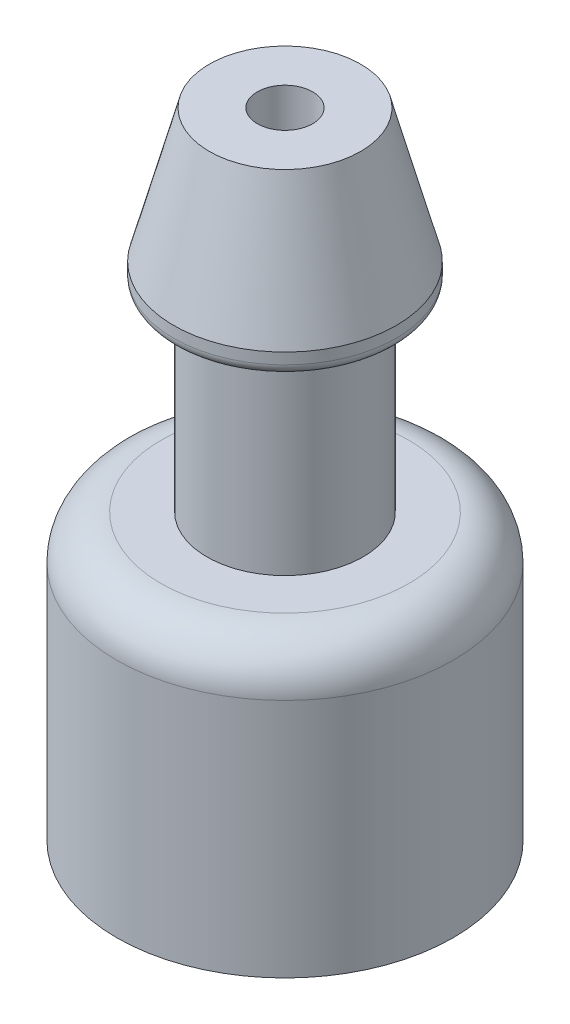
ISO-10303-21;
HEADER;
FILE_DESCRIPTION(('STEP AP214'),'2;1');
FILE_NAME('part.step','',(''),(''),'','','');
FILE_SCHEMA(('AUTOMOTIVE_DESIGN { 1 0 10303 214 1 1 1 1 }'));
ENDSEC;
DATA;
#1=APPLICATION_CONTEXT('core data for automotive mechanical design processes');
#2=APPLICATION_PROTOCOL_DEFINITION('international standard','automotive_design',2000,#1);
#3=PRODUCT_CONTEXT('',#1,'mechanical');
#4=PRODUCT('Part','Part','',(#3));
#5=PRODUCT_RELATED_PRODUCT_CATEGORY('part','',(#4));
#6=PRODUCT_DEFINITION_FORMATION('','',#4);
#7=PRODUCT_DEFINITION_CONTEXT('part definition',#1,'design');
#8=PRODUCT_DEFINITION('design','',#6,#7);
#9=PRODUCT_DEFINITION_SHAPE('','',#8);
#10=(LENGTH_UNIT() NAMED_UNIT(*) SI_UNIT(.MILLI.,.METRE.));
#11=(NAMED_UNIT(*) PLANE_ANGLE_UNIT() SI_UNIT($,.RADIAN.));
#12=(NAMED_UNIT(*) SI_UNIT($,.STERADIAN.) SOLID_ANGLE_UNIT());
#13=UNCERTAINTY_MEASURE_WITH_UNIT(LENGTH_MEASURE(1.E-05),#10,'distance_accuracy_value','');
#14=(GEOMETRIC_REPRESENTATION_CONTEXT(3) GLOBAL_UNCERTAINTY_ASSIGNED_CONTEXT((#13)) GLOBAL_UNIT_ASSIGNED_CONTEXT((#10,
#11,#12)) REPRESENTATION_CONTEXT('',''));
#15=CARTESIAN_POINT('',(0.,0.,0.));
#16=DIRECTION('',(0.,0.,1.));
#17=DIRECTION('',(1.,0.,0.));
#18=AXIS2_PLACEMENT_3D('',#15,#16,#17);
#19=CARTESIAN_POINT('',(0.,25.0000000000341,0.));
#20=DIRECTION('',(0.,-1.,0.));
#21=DIRECTION('',(1.,0.,0.));
#22=AXIS2_PLACEMENT_3D('',#19,#20,#21);
#23=CONICAL_SURFACE('',#22,5.02499999998918,0.261977344231984);
#24=CARTESIAN_POINT('',(0.,25.,0.));
#25=DIRECTION('',(0.,-1.,0.));
#26=DIRECTION('',(0.,0.,-1.));
#27=AXIS2_PLACEMENT_3D('',#24,#25,#26);
#28=CIRCLE('',#27,5.025);
#29=CARTESIAN_POINT('',(0.,25.,-5.025));
#30=VERTEX_POINT('',#29);
#31=EDGE_CURVE('E125',#30,#30,#28,.T.);
#32=ORIENTED_EDGE('',*,*,#31,.F.);
#33=EDGE_LOOP('',(#32));
#34=FACE_BOUND('',#33,.T.);
#35=CARTESIAN_POINT('',(0.,30.9999999998922,0.));
#36=DIRECTION('',(0.,-1.,0.));
#37=DIRECTION('',(1.,0.,0.));
#38=AXIS2_PLACEMENT_3D('',#35,#36,#37);
#39=CIRCLE('',#38,3.41616039207793);
#40=CARTESIAN_POINT('',(3.41616039207794,30.9999999998922,0.));
#41=VERTEX_POINT('',#40);
#42=EDGE_CURVE('E20',#41,#41,#39,.F.);
#43=ORIENTED_EDGE('',*,*,#42,.F.);
#44=EDGE_LOOP('',(#43));
#45=FACE_BOUND('',#44,.T.);
#46=ADVANCED_FACE('F16',(#34,#45),#23,.T.);
#47=CARTESIAN_POINT('',(0.,31.,0.));
#48=DIRECTION('',(0.,1.,0.));
#49=DIRECTION('',(0.,0.,1.));
#50=AXIS2_PLACEMENT_3D('',#47,#48,#49);
#51=PLANE('',#50);
#52=ORIENTED_EDGE('',*,*,#42,.T.);
#53=EDGE_LOOP('',(#52));
#54=FACE_BOUND('',#53,.T.);
#55=CARTESIAN_POINT('',(0.,31.,0.));
#56=DIRECTION('',(0.,-1.,0.));
#57=DIRECTION('',(0.,0.,-1.));
#58=AXIS2_PLACEMENT_3D('',#55,#56,#57);
#59=CIRCLE('',#58,1.25);
#60=CARTESIAN_POINT('',(0.,31.,-1.25));
#61=VERTEX_POINT('',#60);
#62=EDGE_CURVE('E124',#61,#61,#59,.T.);
#63=ORIENTED_EDGE('',*,*,#62,.T.);
#64=EDGE_LOOP('',(#63));
#65=FACE_BOUND('',#64,.T.);
#66=ADVANCED_FACE('F88',(#54,#65),#51,.T.);
#67=CARTESIAN_POINT('',(0.,29.4,0.));
#68=DIRECTION('',(0.,-1.,0.));
#69=DIRECTION('',(0.,0.,-1.));
#70=AXIS2_PLACEMENT_3D('',#67,#68,#69);
#71=CYLINDRICAL_SURFACE('',#70,5.025);
#72=CARTESIAN_POINT('',(0.,24.5,0.));
#73=DIRECTION('',(0.,-1.,0.));
#74=DIRECTION('',(0.,0.,-1.));
#75=AXIS2_PLACEMENT_3D('',#72,#73,#74);
#76=CIRCLE('',#75,5.025);
#77=CARTESIAN_POINT('',(0.,24.5,-5.025));
#78=VERTEX_POINT('',#77);
#79=EDGE_CURVE('E116',#78,#78,#76,.T.);
#80=ORIENTED_EDGE('',*,*,#79,.F.);
#81=EDGE_LOOP('',(#80));
#82=FACE_BOUND('',#81,.T.);
#83=ORIENTED_EDGE('',*,*,#31,.T.);
#84=EDGE_LOOP('',(#83));
#85=FACE_BOUND('',#84,.T.);
#86=ADVANCED_FACE('F92',(#82,#85),#71,.T.);
#87=CARTESIAN_POINT('',(0.,13.2,0.));
#88=DIRECTION('',(0.,-1.,0.));
#89=DIRECTION('',(0.,0.,-1.));
#90=AXIS2_PLACEMENT_3D('',#87,#88,#89);
#91=CYLINDRICAL_SURFACE('',#90,1.25);
#92=ORIENTED_EDGE('',*,*,#62,.F.);
#93=EDGE_LOOP('',(#92));
#94=FACE_BOUND('',#93,.T.);
#95=CARTESIAN_POINT('',(0.,13.2,0.));
#96=DIRECTION('',(0.,-1.,0.));
#97=DIRECTION('',(0.,0.,-1.));
#98=AXIS2_PLACEMENT_3D('',#95,#96,#97);
#99=CIRCLE('',#98,1.25);
#100=CARTESIAN_POINT('',(0.,13.2,-1.25));
#101=VERTEX_POINT('',#100);
#102=EDGE_CURVE('E123',#101,#101,#99,.F.);
#103=ORIENTED_EDGE('',*,*,#102,.F.);
#104=EDGE_LOOP('',(#103));
#105=FACE_BOUND('',#104,.T.);
#106=ADVANCED_FACE('F84',(#94,#105),#91,.F.);
#107=CARTESIAN_POINT('',(0.,24.5,0.));
#108=DIRECTION('',(0.,-1.,0.));
#109=DIRECTION('',(0.,0.,-1.));
#110=AXIS2_PLACEMENT_3D('',#107,#108,#109);
#111=TOROIDAL_SURFACE('',#110,4.52500000000001,0.499999999999993);
#112=ORIENTED_EDGE('',*,*,#79,.T.);
#113=EDGE_LOOP('',(#112));
#114=FACE_BOUND('',#113,.T.);
#115=CARTESIAN_POINT('',(0.,24.,0.));
#116=DIRECTION('',(0.,-1.,0.));
#117=DIRECTION('',(0.,0.,-1.));
#118=AXIS2_PLACEMENT_3D('',#115,#116,#117);
#119=CIRCLE('',#118,4.52499999999999);
#120=CARTESIAN_POINT('',(-4.52500338379992,24.0000000000115,0.));
#121=VERTEX_POINT('',#120);
#122=CARTESIAN_POINT('',(4.52500000000001,24.,0.));
#123=VERTEX_POINT('',#122);
#124=EDGE_CURVE('E113',#121,#123,#119,.T.);
#125=ORIENTED_EDGE('',*,*,#124,.F.);
#126=CARTESIAN_POINT('',(4.52421311975968,24.,0.084746162375779));
#127=CARTESIAN_POINT('',(4.50823805324613,24.,0.943648799944314));
#128=CARTESIAN_POINT('',(4.17766488760787,24.,1.73863608527079));
#129=CARTESIAN_POINT('',(4.00285406444518,24.,2.15903433956791));
#130=CARTESIAN_POINT('',(3.74600547001581,24.,2.53834195965187));
#131=CARTESIAN_POINT('',(3.48570836146743,24.,2.92274225967133));
#132=CARTESIAN_POINT('',(3.15051408798487,24.,3.24807453955982));
#133=CARTESIAN_POINT('',(2.81784837193939,24.,3.57095265653171));
#134=CARTESIAN_POINT('',(2.42407543151326,24.,3.82093845517079));
#135=CARTESIAN_POINT('',(2.04230655564591,24.,4.0633035024642));
#136=CARTESIAN_POINT('',(1.6162831250141,24.,4.22651113942972));
#137=CARTESIAN_POINT('',(0.817768037406887,24.,4.532418634556));
#138=CARTESIAN_POINT('',(-0.0423732220297558,24.,4.52481285866396));
#139=CARTESIAN_POINT('',(-0.899233744975421,24.,4.51723609259587));
#140=CARTESIAN_POINT('',(-1.69699297170252,24.,4.19474453847613));
#141=CARTESIAN_POINT('',(-2.1188205061625,24.,4.0242221394854));
#142=CARTESIAN_POINT('',(-2.50014475187266,24.,3.77159612838526));
#143=CARTESIAN_POINT('',(-2.88732926068748,24.,3.51508771298279));
#144=CARTESIAN_POINT('',(-3.21588670260604,24.,3.18335138863748));
#145=CARTESIAN_POINT('',(-3.5426018464065,24.,2.8534751871446));
#146=CARTESIAN_POINT('',(-3.7966243027784,24.,2.46196846808334));
#147=CARTESIAN_POINT('',(-4.04386957135677,24.,2.08090694585783));
#148=CARTESIAN_POINT('',(-4.21118260734075,24.,1.65577191104153));
#149=CARTESIAN_POINT('',(-4.52460075483811,24.,0.859390240810476));
#150=CARTESIAN_POINT('',(-4.52499999999999,24.,0.));
#151=B_SPLINE_CURVE_WITH_KNOTS('',2,(#126,#127,#128,#129,#130,#131,#132,#133,#134,#135,#136,
#137,#138,#139,#140,#141,#142,#143,#144,#145,#146,#147,#148,#149,#150),.UNSPECIFIED.,.F.,.F.,(3,
2,2,2,2,2,2,2,2,2,2,2,3),(0.,0.125,0.1875,0.25,0.3125,0.375,0.5,0.625,0.6875,0.75,0.8125,0.875,
1.),.UNSPECIFIED.);
#152=CARTESIAN_POINT('',(4.52421011015311,24.,0.0847441735240896));
#153=VERTEX_POINT('',#152);
#154=EDGE_CURVE('E108',#153,#121,#151,.T.);
#155=ORIENTED_EDGE('',*,*,#154,.F.);
#156=DIRECTION('',(-0.00928474281853149,0.,0.999956895846413));
#157=VECTOR('',#156,1.);
#158=CARTESIAN_POINT('',(4.52500000000001,24.,0.));
#159=LINE('',#158,#157);
#160=EDGE_CURVE('E114',#123,#153,#159,.T.);
#161=ORIENTED_EDGE('',*,*,#160,.F.);
#162=EDGE_LOOP('',(#125,#155,#161));
#163=FACE_BOUND('',#162,.T.);
#164=ADVANCED_FACE('F81',(#114,#163),#111,.T.);
#165=CARTESIAN_POINT('',(0.,13.2,-21.5));
#166=DIRECTION('',(0.,-1.,0.));
#167=DIRECTION('',(0.,0.,-1.));
#168=AXIS2_PLACEMENT_3D('',#165,#166,#167);
#169=PLANE('',#168);
#170=DIRECTION('',(-0.999928054189659,0.,-0.0119952675869598));
#171=VECTOR('',#170,1.);
#172=CARTESIAN_POINT('',(0.,13.2,5.25));
#173=LINE('',#172,#171);
#174=CARTESIAN_POINT('',(0.,13.2,5.25));
#175=VERTEX_POINT('',#174);
#176=CARTESIAN_POINT('',(-0.126936746080075,13.1999999999276,5.24847725020868));
#177=VERTEX_POINT('',#176);
#178=EDGE_CURVE('E34',#175,#177,#173,.T.);
#179=ORIENTED_EDGE('',*,*,#178,.T.);
#180=CARTESIAN_POINT('',(0.,13.2,-5.25));
#181=CARTESIAN_POINT('',(-0.0852418173099452,13.2,-5.25000182948103));
#182=CARTESIAN_POINT('',(-0.170483486963965,13.2,-5.24792414451757));
#183=CARTESIAN_POINT('',(-0.340764705952979,13.1999999999999,-5.2396224315028));
#184=CARTESIAN_POINT('',(-0.425804255280734,13.1999999999999,-5.23339840330296));
#185=CARTESIAN_POINT('',(-0.59547940551303,13.1999999999998,-5.21681668932127));
#186=CARTESIAN_POINT('',(-0.680115006403102,13.1999999999998,-5.20645900339134));
#187=CARTESIAN_POINT('',(-0.848781518347325,13.1999999999996,-5.18163510060481));
#188=CARTESIAN_POINT('',(-0.932812429379814,13.1999999999995,-5.16716888360104));
#189=CARTESIAN_POINT('',(-1.10007022017244,13.1999999999993,-5.13416208520981));
#190=CARTESIAN_POINT('',(-1.18329709990377,13.1999999999992,-5.11562150367639));
#191=CARTESIAN_POINT('',(-1.34874940315242,13.199999999999,-5.07450999700364));
#192=CARTESIAN_POINT('',(-1.43097482663386,13.1999999999989,-5.05193907171993));
#193=CARTESIAN_POINT('',(-1.59422916556199,13.1999999999986,-5.00282040821553));
#194=CARTESIAN_POINT('',(-1.67525808096583,13.1999999999984,-4.97627266985237));
#195=CARTESIAN_POINT('',(-1.83592719086569,13.1999999999981,-4.91926335805346));
#196=CARTESIAN_POINT('',(-1.91556738531198,13.1999999999979,-4.88880178447749));
#197=CARTESIAN_POINT('',(-2.07327013449008,13.1999999999975,-4.8240370606948));
#198=CARTESIAN_POINT('',(-2.15133268916537,13.1999999999973,-4.78973391035047));
#199=CARTESIAN_POINT('',(-2.30569498243063,13.1999999999969,-4.71736740525861));
#200=CARTESIAN_POINT('',(-2.38199472095743,13.1999999999967,-4.67930405037638));
#201=CARTESIAN_POINT('',(-2.5326503871972,13.1999999999962,-4.59950742795856));
#202=CARTESIAN_POINT('',(-2.60700631484053,13.199999999996,-4.5577741602915));
#203=CARTESIAN_POINT('',(-2.7535979755907,13.1999999999955,-4.47073670972239));
#204=CARTESIAN_POINT('',(-2.8258337086216,13.1999999999952,-4.42543252669242));
#205=CARTESIAN_POINT('',(-2.96801362583526,13.1999999999946,-4.33136071355921));
#206=CARTESIAN_POINT('',(-3.03795780993593,13.1999999999943,-4.2825930833319));
#207=CARTESIAN_POINT('',(-3.17538871086846,13.1999999999937,-4.1817100598027));
#208=CARTESIAN_POINT('',(-3.2428754276123,13.1999999999934,-4.12959466638088));
#209=CARTESIAN_POINT('',(-3.37523130488538,13.1999999999927,-4.0221397418724));
#210=CARTESIAN_POINT('',(-3.44010046532085,13.1999999999924,-3.96680021067024));
#211=CARTESIAN_POINT('',(-3.56706735026217,13.1999999999917,-3.85302828416586));
#212=CARTESIAN_POINT('',(-3.62916507466872,13.1999999999913,-3.79459588875284));
#213=CARTESIAN_POINT('',(-3.75044178209444,13.1999999999906,-3.67477684414575));
#214=CARTESIAN_POINT('',(-3.80962076500904,13.1999999999902,-3.61339019484586));
#215=CARTESIAN_POINT('',(-3.92491960768186,13.1999999999894,-3.48780826073411));
#216=CARTESIAN_POINT('',(-3.9810394673305,13.199999999989,-3.42361297582165));
#217=CARTESIAN_POINT('',(-4.09008693839858,13.1999999999881,-3.29256605127569));
#218=CARTESIAN_POINT('',(-4.14301454970368,13.1999999999877,-3.22571441154704));
#219=CARTESIAN_POINT('',(-4.24555197150161,13.1999999999868,-3.0895133594487));
#220=CARTESIAN_POINT('',(-4.29516178187558,13.1999999999863,-3.02016394698953));
#221=CARTESIAN_POINT('',(-4.39094591954821,13.1999999999854,-2.87913185661883));
#222=CARTESIAN_POINT('',(-4.43712024672381,13.1999999999849,-2.80744917862371));
#223=CARTESIAN_POINT('',(-4.5259238852176,13.1999999999839,-2.66192059924273));
#224=CARTESIAN_POINT('',(-4.56855319640879,13.1999999999834,-2.58807469777937));
#225=CARTESIAN_POINT('',(-4.65016567946159,13.1999999999824,-2.43839484503125));
#226=CARTESIAN_POINT('',(-4.68914885119257,13.1999999999818,-2.36256089367526));
#227=CARTESIAN_POINT('',(-4.76337658104361,13.1999999999807,-2.20908483068085));
#228=CARTESIAN_POINT('',(-4.79862113902974,13.1999999999802,-2.13144271897765));
#229=CARTESIAN_POINT('',(-4.86528803566423,13.1999999999791,-1.97453451407239));
#230=CARTESIAN_POINT('',(-4.89671037417568,13.1999999999785,-1.89526842081216));
#231=CARTESIAN_POINT('',(-4.9556582930147,13.1999999999773,-1.73530028392117));
#232=CARTESIAN_POINT('',(-4.98318387320269,13.1999999999767,-1.65459824023898));
#233=CARTESIAN_POINT('',(-5.0342729802475,13.1999999999755,-1.49194963993897));
#234=CARTESIAN_POINT('',(-5.0578365069624,13.1999999999748,-1.41000308327658));
#235=CARTESIAN_POINT('',(-5.1009456105033,13.1999999999736,-1.2450598466391));
#236=CARTESIAN_POINT('',(-5.12049118718538,13.1999999999729,-1.1620631666264));
#237=CARTESIAN_POINT('',(-5.15551802528827,13.1999999999716,-0.995216563977667));
#238=CARTESIAN_POINT('',(-5.1709992865635,13.1999999999709,-0.911366641311074));
#239=CARTESIAN_POINT('',(-5.19786076965211,13.1999999999696,-0.743012458079556));
#240=CARTESIAN_POINT('',(-5.20924099131858,13.1999999999689,-0.658508197491189));
#241=CARTESIAN_POINT('',(-5.22787339927696,13.1999999999675,-0.489045795344562));
#242=CARTESIAN_POINT('',(-5.235125585421,13.1999999999667,-0.404087653770042));
#243=CARTESIAN_POINT('',(-5.24548471874878,13.1999999999653,-0.233919023268732));
#244=CARTESIAN_POINT('',(-5.24859166578404,13.1999999999645,-0.148708534332901));
#245=CARTESIAN_POINT('',(-5.25065295044574,13.199999999963,0.0217626586525991));
#246=CARTESIAN_POINT('',(-5.24960728792343,13.1999999999623,0.107023362704067));
#247=CARTESIAN_POINT('',(-5.24336583364324,13.1999999999607,0.277392734550025));
#248=CARTESIAN_POINT('',(-5.23817004173669,13.1999999999599,0.362501402339068));
#249=CARTESIAN_POINT('',(-5.22364065360035,13.1999999999583,0.532364810928036));
#250=CARTESIAN_POINT('',(-5.21430705722234,13.1999999999575,0.617119551715282));
#251=CARTESIAN_POINT('',(-5.19152420055863,13.1999999999558,0.786074055122804));
#252=CARTESIAN_POINT('',(-5.17807494012552,13.199999999955,0.870273817723199));
#253=CARTESIAN_POINT('',(-5.14709265875068,13.1999999999533,1.03791863005753));
#254=CARTESIAN_POINT('',(-5.12955963766268,13.1999999999524,1.12136367976444));
#255=CARTESIAN_POINT('',(-5.09045142568162,13.1999999999507,1.28730112189192));
#256=CARTESIAN_POINT('',(-5.06887623464377,13.1999999999498,1.36979351427836));
#257=CARTESIAN_POINT('',(-5.02173486211226,13.199999999948,1.53362995717912));
#258=CARTESIAN_POINT('',(-4.99616868047563,13.1999999999471,1.61497400765229));
#259=CARTESIAN_POINT('',(-4.94110597333696,13.1999999999453,1.77632080616857));
#260=CARTESIAN_POINT('',(-4.91160944769412,13.1999999999443,1.85632355416362));
#261=CARTESIAN_POINT('',(-4.84875602251231,13.1999999999425,2.01479796892564));
#262=CARTESIAN_POINT('',(-4.81539912283504,13.1999999999415,2.09326963563777));
#263=CARTESIAN_POINT('',(-4.74490407695377,13.1999999999396,2.24849574098031));
#264=CARTESIAN_POINT('',(-4.70776593061431,13.1999999999386,2.3252501795492));
#265=CARTESIAN_POINT('',(-4.62979648847665,13.1999999999366,2.47685975526498));
#266=CARTESIAN_POINT('',(-4.58896519254615,13.1999999999356,2.55171489234383));
#267=CARTESIAN_POINT('',(-4.50370630901397,13.1999999999336,2.69934829715854));
#268=CARTESIAN_POINT('',(-4.45927872128347,13.1999999999326,2.77212656482002));
#269=CARTESIAN_POINT('',(-4.36693264289763,13.1999999999305,2.91543358951685));
#270=CARTESIAN_POINT('',(-4.31901415211725,13.1999999999294,2.98596234647163));
#271=CARTESIAN_POINT('',(-4.21979993733921,13.1999999999273,3.12460304464154));
#272=CARTESIAN_POINT('',(-4.16850421322057,13.1999999999262,3.1927149857701));
#273=CARTESIAN_POINT('',(-4.06265721279352,13.1999999999241,3.32636048021725));
#274=CARTESIAN_POINT('',(-4.00810593636849,13.199999999923,3.39189403344348));
#275=CARTESIAN_POINT('',(-3.89587723503073,13.1999999999208,3.52022729633285));
#276=CARTESIAN_POINT('',(-3.83819981000603,13.1999999999196,3.58302700589805));
#277=CARTESIAN_POINT('',(-3.71985563088083,13.1999999999174,3.70574361079461));
#278=CARTESIAN_POINT('',(-3.65918887667326,13.1999999999162,3.76566050602268));
#279=CARTESIAN_POINT('',(-3.53500994974813,13.1999999999139,3.8824693500382));
#280=CARTESIAN_POINT('',(-3.47149777692864,13.1999999999128,3.93936129871728));
#281=CARTESIAN_POINT('',(-3.34177867312204,13.1999999999104,4.04998529305161));
#282=CARTESIAN_POINT('',(-3.27557174203839,13.1999999999092,4.10371733859367));
#283=CARTESIAN_POINT('',(-3.14062017443365,13.1999999999068,4.20789406583296));
#284=CARTESIAN_POINT('',(-3.07187553782165,13.1999999999056,4.25833874741243));
#285=CARTESIAN_POINT('',(-2.93201163172551,13.1999999999031,4.35582108402297));
#286=CARTESIAN_POINT('',(-2.86089236215631,13.1999999999019,4.402858738932));
#287=CARTESIAN_POINT('',(-2.71644789571414,13.1999999998994,4.49341544148071));
#288=CARTESIAN_POINT('',(-2.64312269876215,13.1999999998981,4.53693448899434));
#289=CARTESIAN_POINT('',(-2.4944403159292,13.1999999998956,4.62035074267713));
#290=CARTESIAN_POINT('',(-2.41908312997545,13.1999999998943,4.66024794871654));
#291=CARTESIAN_POINT('',(-2.26651552771867,13.1999999998917,4.73632587699785));
#292=CARTESIAN_POINT('',(-2.18930511134927,13.1999999998904,4.77250659910662));
#293=CARTESIAN_POINT('',(-2.03321420297944,13.1999999998878,4.84106573287174));
#294=CARTESIAN_POINT('',(-1.95433371091919,13.1999999998864,4.87344414439187));
#295=CARTESIAN_POINT('',(-1.79508976764404,13.1999999998837,4.93432185095238));
#296=CARTESIAN_POINT('',(-1.71472631637601,13.1999999998824,4.96282114585379));
#297=CARTESIAN_POINT('',(-1.55270708871473,13.1999999998796,5.01587301136453));
#298=CARTESIAN_POINT('',(-1.47105131227519,13.1999999998783,5.04042558183249));
#299=CARTESIAN_POINT('',(-1.30664113489661,13.1999999998755,5.08552576645596));
#300=CARTESIAN_POINT('',(-1.22388673391822,13.1999999998741,5.10607338046801));
#301=CARTESIAN_POINT('',(-1.0574756105096,13.1999999998712,5.14311486989509));
#302=CARTESIAN_POINT('',(-0.973818888047052,13.1999999998698,5.15960874516491));
#303=CARTESIAN_POINT('',(-0.805801578971967,13.1999999998669,5.18850377984638));
#304=CARTESIAN_POINT('',(-0.721440992334216,13.1999999998655,5.20090493911142));
#305=CARTESIAN_POINT('',(-0.552216030409884,13.1999999998626,5.22158456792662));
#306=CARTESIAN_POINT('',(-0.467351655105256,13.1999999998611,5.22986303732909));
#307=CARTESIAN_POINT('',(-0.297320578581641,13.1999999998581,5.24227972382095));
#308=CARTESIAN_POINT('',(-0.212153877351824,13.1999999998566,5.24641794076202));
#309=CARTESIAN_POINT('',(-0.126936746080075,13.1999999998551,5.24847725020868));
#310=B_SPLINE_CURVE_WITH_KNOTS('',3,(#180,#181,#182,#183,#184,#185,#186,#187,#188,#189,#190,
#191,#192,#193,#194,#195,#196,#197,#198,#199,#200,#201,#202,#203,#204,#205,#206,#207,#208,#209,
#210,#211,#212,#213,#214,#215,#216,#217,#218,#219,#220,#221,#222,#223,#224,#225,#226,#227,#228,
#229,#230,#231,#232,#233,#234,#235,#236,#237,#238,#239,#240,#241,#242,#243,#244,#245,#246,#247,
#248,#249,#250,#251,#252,#253,#254,#255,#256,#257,#258,#259,#260,#261,#262,#263,#264,#265,#266,
#267,#268,#269,#270,#271,#272,#273,#274,#275,#276,#277,#278,#279,#280,#281,#282,#283,#284,#285,
#286,#287,#288,#289,#290,#291,#292,#293,#294,#295,#296,#297,#298,#299,#300,#301,#302,#303,#304,
#305,#306,#307,#308,#309),.UNSPECIFIED.,.F.,.F.,(4,2,2,2,2,2,2,2,2,2,2,2,2,2,2,2,2,2,2,2,2,2,2,
2,2,2,2,2,2,2,2,2,2,2,2,2,2,2,2,2,2,2,2,2,2,2,2,2,2,2,2,2,2,2,2,2,2,2,2,2,2,2,2,2,4),(0.,
0.25569992149361,0.511399852147141,0.767099791960594,1.02279974093397,1.27849969906727,
1.53419966636048,1.78989964281362,2.04559962842668,2.30129962319967,2.55699962713257,
2.8126996402254,3.06839966247814,3.32409969389082,3.57979973446341,3.83549978419593,
4.09119984308836,4.34689991114072,4.602599988353,4.8583000747252,5.11400017025732,
5.36970027494937,5.62540038880134,5.88110051181322,6.13680064398503,6.39250078531677,
6.64820093580842,6.90390109545999,7.15960126427149,7.41530144224291,7.67100162937425,
7.92670182566552,8.1824020311167,8.4381022457278,8.69380246949883,8.94950270242978,
9.20520294452065,9.46090319577145,9.71660345618216,9.9723037257528,10.2280040044834,
10.4837042923738,10.7394045894242,10.9951048956346,11.2508052110048,11.506505535535,
11.7622058692251,12.0179062120751,12.273606564085,12.5293069252549,12.7850072955846,
13.0407076750743,13.296408063724,13.5521084615335,13.807808868503,14.0635092846324,
14.3192097099217,14.5749101443709,14.83061058798,15.0863110407491,15.3420115026781,
15.597711973767,15.8534124540159,16.1091129434246,16.3648134419933),.UNSPECIFIED.);
#311=CARTESIAN_POINT('',(0.,13.2,-5.25));
#312=VERTEX_POINT('',#311);
#313=EDGE_CURVE('E54',#177,#312,#310,.F.);
#314=ORIENTED_EDGE('',*,*,#313,.T.);
#315=DIRECTION('',(0.999928054189658,0.,0.0119952675869871));
#316=VECTOR('',#315,1.);
#317=CARTESIAN_POINT('',(0.,13.2,-5.25));
#318=LINE('',#317,#316);
#319=CARTESIAN_POINT('',(0.126936746080076,13.1999999999276,-5.24847725020868));
#320=VERTEX_POINT('',#319);
#321=EDGE_CURVE('E49',#312,#320,#318,.T.);
#322=ORIENTED_EDGE('',*,*,#321,.T.);
#323=CARTESIAN_POINT('',(0.,13.2,5.25));
#324=CARTESIAN_POINT('',(0.0852418173099438,13.2,5.25000182948103));
#325=CARTESIAN_POINT('',(0.170483486963963,13.2,5.24792414451756));
#326=CARTESIAN_POINT('',(0.340764705952977,13.1999999999999,5.2396224315028));
#327=CARTESIAN_POINT('',(0.425804255280733,13.1999999999999,5.23339840330296));
#328=CARTESIAN_POINT('',(0.595479405513029,13.1999999999998,5.21681668932127));
#329=CARTESIAN_POINT('',(0.6801150064031,13.1999999999998,5.20645900339134));
#330=CARTESIAN_POINT('',(0.848781518347323,13.1999999999996,5.18163510060481));
#331=CARTESIAN_POINT('',(0.932812429379813,13.1999999999995,5.16716888360104));
#332=CARTESIAN_POINT('',(1.10007022017244,13.1999999999993,5.13416208520981));
#333=CARTESIAN_POINT('',(1.18329709990377,13.1999999999992,5.11562150367639));
#334=CARTESIAN_POINT('',(1.34874940315242,13.199999999999,5.07450999700364));
#335=CARTESIAN_POINT('',(1.43097482663386,13.1999999999989,5.05193907171993));
#336=CARTESIAN_POINT('',(1.59422916556199,13.1999999999986,5.00282040821552));
#337=CARTESIAN_POINT('',(1.67525808096583,13.1999999999984,4.97627266985237));
#338=CARTESIAN_POINT('',(1.83592719086569,13.1999999999981,4.91926335805346));
#339=CARTESIAN_POINT('',(1.91556738531198,13.1999999999979,4.88880178447749));
#340=CARTESIAN_POINT('',(2.07327013449008,13.1999999999975,4.8240370606948));
#341=CARTESIAN_POINT('',(2.15133268916537,13.1999999999973,4.78973391035047));
#342=CARTESIAN_POINT('',(2.30569498243063,13.1999999999969,4.7173674052586));
#343=CARTESIAN_POINT('',(2.38199472095744,13.1999999999967,4.67930405037637));
#344=CARTESIAN_POINT('',(2.5326503871972,13.1999999999962,4.59950742795855));
#345=CARTESIAN_POINT('',(2.60700631484052,13.199999999996,4.5577741602915));
#346=CARTESIAN_POINT('',(2.7535979755907,13.1999999999955,4.47073670972239));
#347=CARTESIAN_POINT('',(2.8258337086216,13.1999999999952,4.42543252669242));
#348=CARTESIAN_POINT('',(2.96801362583526,13.1999999999946,4.33136071355921));
#349=CARTESIAN_POINT('',(3.03795780993593,13.1999999999943,4.2825930833319));
#350=CARTESIAN_POINT('',(3.17538871086846,13.1999999999937,4.1817100598027));
#351=CARTESIAN_POINT('',(3.2428754276123,13.1999999999934,4.12959466638088));
#352=CARTESIAN_POINT('',(3.37523130488538,13.1999999999927,4.0221397418724));
#353=CARTESIAN_POINT('',(3.44010046532086,13.1999999999924,3.96680021067024));
#354=CARTESIAN_POINT('',(3.56706735026217,13.1999999999917,3.85302828416585));
#355=CARTESIAN_POINT('',(3.62916507466873,13.1999999999913,3.79459588875284));
#356=CARTESIAN_POINT('',(3.75044178209444,13.1999999999906,3.67477684414575));
#357=CARTESIAN_POINT('',(3.80962076500905,13.1999999999902,3.61339019484586));
#358=CARTESIAN_POINT('',(3.92491960768187,13.1999999999894,3.48780826073411));
#359=CARTESIAN_POINT('',(3.9810394673305,13.199999999989,3.42361297582165));
#360=CARTESIAN_POINT('',(4.09008693839858,13.1999999999881,3.29256605127569));
#361=CARTESIAN_POINT('',(4.14301454970369,13.1999999999877,3.22571441154703));
#362=CARTESIAN_POINT('',(4.24555197150161,13.1999999999868,3.08951335944869));
#363=CARTESIAN_POINT('',(4.29516178187558,13.1999999999863,3.02016394698953));
#364=CARTESIAN_POINT('',(4.39094591954822,13.1999999999854,2.87913185661883));
#365=CARTESIAN_POINT('',(4.43712024672382,13.1999999999849,2.8074491786237));
#366=CARTESIAN_POINT('',(4.5259238852176,13.1999999999839,2.66192059924272));
#367=CARTESIAN_POINT('',(4.56855319640879,13.1999999999834,2.58807469777937));
#368=CARTESIAN_POINT('',(4.65016567946159,13.1999999999824,2.43839484503125));
#369=CARTESIAN_POINT('',(4.68914885119257,13.1999999999818,2.36256089367526));
#370=CARTESIAN_POINT('',(4.76337658104361,13.1999999999807,2.20908483068085));
#371=CARTESIAN_POINT('',(4.79862113902974,13.1999999999802,2.13144271897765));
#372=CARTESIAN_POINT('',(4.86528803566423,13.1999999999791,1.97453451407239));
#373=CARTESIAN_POINT('',(4.89671037417568,13.1999999999785,1.89526842081216));
#374=CARTESIAN_POINT('',(4.9556582930147,13.1999999999773,1.73530028392117));
#375=CARTESIAN_POINT('',(4.98318387320269,13.1999999999767,1.65459824023898));
#376=CARTESIAN_POINT('',(5.0342729802475,13.1999999999755,1.49194963993897));
#377=CARTESIAN_POINT('',(5.0578365069624,13.1999999999748,1.41000308327658));
#378=CARTESIAN_POINT('',(5.1009456105033,13.1999999999736,1.2450598466391));
#379=CARTESIAN_POINT('',(5.12049118718538,13.1999999999729,1.16206316662639));
#380=CARTESIAN_POINT('',(5.15551802528828,13.1999999999716,0.995216563977662));
#381=CARTESIAN_POINT('',(5.1709992865635,13.1999999999709,0.91136664131107));
#382=CARTESIAN_POINT('',(5.19786076965211,13.1999999999696,0.743012458079552));
#383=CARTESIAN_POINT('',(5.20924099131858,13.1999999999689,0.658508197491185));
#384=CARTESIAN_POINT('',(5.22787339927696,13.1999999999675,0.489045795344559));
#385=CARTESIAN_POINT('',(5.235125585421,13.1999999999667,0.40408765377004));
#386=CARTESIAN_POINT('',(5.24548471874878,13.1999999999653,0.233919023268729));
#387=CARTESIAN_POINT('',(5.24859166578404,13.1999999999645,0.148708534332899));
#388=CARTESIAN_POINT('',(5.25065295044574,13.199999999963,-0.0217626586526013));
#389=CARTESIAN_POINT('',(5.24960728792343,13.1999999999623,-0.107023362704069));
#390=CARTESIAN_POINT('',(5.24336583364324,13.1999999999607,-0.277392734550027));
#391=CARTESIAN_POINT('',(5.23817004173669,13.1999999999599,-0.36250140233907));
#392=CARTESIAN_POINT('',(5.22364065360035,13.1999999999583,-0.53236481092804));
#393=CARTESIAN_POINT('',(5.21430705722234,13.1999999999575,-0.617119551715287));
#394=CARTESIAN_POINT('',(5.19152420055863,13.1999999999558,-0.786074055122809));
#395=CARTESIAN_POINT('',(5.17807494012551,13.199999999955,-0.870273817723203));
#396=CARTESIAN_POINT('',(5.14709265875068,13.1999999999533,-1.03791863005754));
#397=CARTESIAN_POINT('',(5.12955963766268,13.1999999999524,-1.12136367976444));
#398=CARTESIAN_POINT('',(5.09045142568162,13.1999999999507,-1.28730112189192));
#399=CARTESIAN_POINT('',(5.06887623464377,13.1999999999498,-1.36979351427837));
#400=CARTESIAN_POINT('',(5.02173486211226,13.199999999948,-1.53362995717912));
#401=CARTESIAN_POINT('',(4.99616868047563,13.1999999999471,-1.6149740076523));
#402=CARTESIAN_POINT('',(4.94110597333696,13.1999999999453,-1.77632080616857));
#403=CARTESIAN_POINT('',(4.91160944769412,13.1999999999443,-1.85632355416362));
#404=CARTESIAN_POINT('',(4.84875602251231,13.1999999999425,-2.01479796892565));
#405=CARTESIAN_POINT('',(4.81539912283504,13.1999999999415,-2.09326963563777));
#406=CARTESIAN_POINT('',(4.74490407695377,13.1999999999396,-2.24849574098031));
#407=CARTESIAN_POINT('',(4.70776593061431,13.1999999999386,-2.3252501795492));
#408=CARTESIAN_POINT('',(4.62979648847665,13.1999999999366,-2.47685975526498));
#409=CARTESIAN_POINT('',(4.58896519254615,13.1999999999356,-2.55171489234383));
#410=CARTESIAN_POINT('',(4.50370630901397,13.1999999999336,-2.69934829715854));
#411=CARTESIAN_POINT('',(4.45927872128347,13.1999999999326,-2.77212656482002));
#412=CARTESIAN_POINT('',(4.36693264289764,13.1999999999305,-2.91543358951685));
#413=CARTESIAN_POINT('',(4.31901415211725,13.1999999999294,-2.98596234647163));
#414=CARTESIAN_POINT('',(4.21979993733921,13.1999999999273,-3.12460304464154));
#415=CARTESIAN_POINT('',(4.16850421322057,13.1999999999262,-3.1927149857701));
#416=CARTESIAN_POINT('',(4.06265721279352,13.1999999999241,-3.32636048021725));
#417=CARTESIAN_POINT('',(4.00810593636849,13.199999999923,-3.39189403344348));
#418=CARTESIAN_POINT('',(3.89587723503073,13.1999999999208,-3.52022729633285));
#419=CARTESIAN_POINT('',(3.83819981000603,13.1999999999196,-3.58302700589806));
#420=CARTESIAN_POINT('',(3.71985563088083,13.1999999999174,-3.70574361079461));
#421=CARTESIAN_POINT('',(3.65918887667326,13.1999999999162,-3.76566050602269));
#422=CARTESIAN_POINT('',(3.53500994974813,13.1999999999139,-3.8824693500382));
#423=CARTESIAN_POINT('',(3.47149777692864,13.1999999999128,-3.93936129871728));
#424=CARTESIAN_POINT('',(3.34177867312204,13.1999999999104,-4.04998529305161));
#425=CARTESIAN_POINT('',(3.27557174203839,13.1999999999092,-4.10371733859368));
#426=CARTESIAN_POINT('',(3.14062017443365,13.1999999999068,-4.20789406583297));
#427=CARTESIAN_POINT('',(3.07187553782165,13.1999999999056,-4.25833874741243));
#428=CARTESIAN_POINT('',(2.93201163172551,13.1999999999031,-4.35582108402297));
#429=CARTESIAN_POINT('',(2.86089236215631,13.1999999999019,-4.40285873893201));
#430=CARTESIAN_POINT('',(2.71644789571414,13.1999999998994,-4.49341544148071));
#431=CARTESIAN_POINT('',(2.64312269876215,13.1999999998981,-4.53693448899434));
#432=CARTESIAN_POINT('',(2.4944403159292,13.1999999998956,-4.62035074267713));
#433=CARTESIAN_POINT('',(2.41908312997545,13.1999999998943,-4.66024794871654));
#434=CARTESIAN_POINT('',(2.26651552771867,13.1999999998917,-4.73632587699785));
#435=CARTESIAN_POINT('',(2.18930511134927,13.1999999998904,-4.77250659910662));
#436=CARTESIAN_POINT('',(2.03321420297944,13.1999999998878,-4.84106573287174));
#437=CARTESIAN_POINT('',(1.9543337109192,13.1999999998864,-4.87344414439187));
#438=CARTESIAN_POINT('',(1.79508976764404,13.1999999998837,-4.93432185095238));
#439=CARTESIAN_POINT('',(1.71472631637601,13.1999999998824,-4.96282114585379));
#440=CARTESIAN_POINT('',(1.55270708871473,13.1999999998796,-5.01587301136453));
#441=CARTESIAN_POINT('',(1.47105131227519,13.1999999998783,-5.04042558183249));
#442=CARTESIAN_POINT('',(1.30664113489661,13.1999999998755,-5.08552576645596));
#443=CARTESIAN_POINT('',(1.22388673391822,13.1999999998741,-5.106073380468));
#444=CARTESIAN_POINT('',(1.0574756105096,13.1999999998712,-5.14311486989509));
#445=CARTESIAN_POINT('',(0.973818888047055,13.1999999998698,-5.15960874516491));
#446=CARTESIAN_POINT('',(0.80580157897197,13.1999999998669,-5.18850377984639));
#447=CARTESIAN_POINT('',(0.721440992334219,13.1999999998655,-5.20090493911142));
#448=CARTESIAN_POINT('',(0.552216030409887,13.1999999998626,-5.22158456792662));
#449=CARTESIAN_POINT('',(0.467351655105258,13.1999999998611,-5.22986303732909));
#450=CARTESIAN_POINT('',(0.297320578581643,13.1999999998581,-5.24227972382095));
#451=CARTESIAN_POINT('',(0.212153877351826,13.1999999998566,-5.24641794076203));
#452=CARTESIAN_POINT('',(0.126936746080077,13.1999999998551,-5.24847725020868));
#453=B_SPLINE_CURVE_WITH_KNOTS('',3,(#323,#324,#325,#326,#327,#328,#329,#330,#331,#332,#333,
#334,#335,#336,#337,#338,#339,#340,#341,#342,#343,#344,#345,#346,#347,#348,#349,#350,#351,#352,
#353,#354,#355,#356,#357,#358,#359,#360,#361,#362,#363,#364,#365,#366,#367,#368,#369,#370,#371,
#372,#373,#374,#375,#376,#377,#378,#379,#380,#381,#382,#383,#384,#385,#386,#387,#388,#389,#390,
#391,#392,#393,#394,#395,#396,#397,#398,#399,#400,#401,#402,#403,#404,#405,#406,#407,#408,#409,
#410,#411,#412,#413,#414,#415,#416,#417,#418,#419,#420,#421,#422,#423,#424,#425,#426,#427,#428,
#429,#430,#431,#432,#433,#434,#435,#436,#437,#438,#439,#440,#441,#442,#443,#444,#445,#446,#447,
#448,#449,#450,#451,#452),.UNSPECIFIED.,.F.,.F.,(4,2,2,2,2,2,2,2,2,2,2,2,2,2,2,2,2,2,2,2,2,2,2,
2,2,2,2,2,2,2,2,2,2,2,2,2,2,2,2,2,2,2,2,2,2,2,2,2,2,2,2,2,2,2,2,2,2,2,2,2,2,2,2,2,4),(0.,
0.255699921493607,0.511399852147141,0.767099791960592,1.02279974093397,1.27849969906726,
1.53419966636048,1.78989964281362,2.04559962842668,2.30129962319967,2.55699962713257,
2.8126996402254,3.06839966247815,3.32409969389082,3.57979973446341,3.83549978419593,
4.09119984308836,4.34689991114072,4.602599988353,4.8583000747252,5.11400017025733,
5.36970027494937,5.62540038880134,5.88110051181322,6.13680064398504,6.39250078531677,
6.64820093580842,6.90390109546,7.15960126427149,7.41530144224291,7.67100162937425,
7.92670182566552,8.1824020311167,8.43810224572781,8.69380246949884,8.94950270242979,
9.20520294452066,9.46090319577145,9.71660345618217,9.97230372575281,10.2280040044834,
10.4837042923738,10.7394045894242,10.9951048956346,11.2508052110048,11.506505535535,
11.7622058692251,12.0179062120751,12.273606564085,12.5293069252549,12.7850072955847,
13.0407076750743,13.296408063724,13.5521084615335,13.807808868503,14.0635092846324,
14.3192097099217,14.5749101443709,14.83061058798,15.0863110407491,15.3420115026781,
15.597711973767,15.8534124540159,16.1091129434246,16.3648134419933),.UNSPECIFIED.);
#454=EDGE_CURVE('E53',#320,#175,#453,.F.);
#455=ORIENTED_EDGE('',*,*,#454,.T.);
#456=EDGE_LOOP('',(#179,#314,#322,#455));
#457=FACE_BOUND('',#456,.T.);
#458=ORIENTED_EDGE('',*,*,#102,.T.);
#459=EDGE_LOOP('',(#458));
#460=FACE_BOUND('',#459,.T.);
#461=ADVANCED_FACE('F51',(#457,#460),#169,.T.);
#462=CARTESIAN_POINT('',(0.,24.,0.));
#463=DIRECTION('',(0.,-1.,0.));
#464=DIRECTION('',(0.,0.,-1.));
#465=AXIS2_PLACEMENT_3D('',#462,#463,#464);
#466=PLANE('',#465);
#467=ORIENTED_EDGE('',*,*,#154,.T.);
#468=ORIENTED_EDGE('',*,*,#124,.T.);
#469=ORIENTED_EDGE('',*,*,#160,.T.);
#470=EDGE_LOOP('',(#467,#468,#469));
#471=FACE_BOUND('',#470,.T.);
#472=CARTESIAN_POINT('',(0.,24.,0.));
#473=DIRECTION('',(0.,-1.,0.));
#474=DIRECTION('',(0.,0.,-1.));
#475=AXIS2_PLACEMENT_3D('',#472,#473,#474);
#476=CIRCLE('',#475,3.525);
#477=CARTESIAN_POINT('',(0.,24.,-3.525));
#478=VERTEX_POINT('',#477);
#479=EDGE_CURVE('E58',#478,#478,#476,.T.);
#480=ORIENTED_EDGE('',*,*,#479,.F.);
#481=EDGE_LOOP('',(#480));
#482=FACE_BOUND('',#481,.T.);
#483=ADVANCED_FACE('F77',(#471,#482),#466,.T.);
#484=CARTESIAN_POINT('',(0.,12.7,0.));
#485=DIRECTION('',(0.,-1.,0.));
#486=DIRECTION('',(0.,0.,-1.));
#487=AXIS2_PLACEMENT_3D('',#484,#485,#486);
#488=TOROIDAL_SURFACE('',#487,5.25,0.499999999999999);
#489=CARTESIAN_POINT('',(0.,12.7,0.));
#490=DIRECTION('',(0.,-1.,0.));
#491=DIRECTION('',(0.,0.,-1.));
#492=AXIS2_PLACEMENT_3D('',#489,#490,#491);
#493=CIRCLE('',#492,5.75);
#494=CARTESIAN_POINT('',(0.,12.7,-5.75));
#495=VERTEX_POINT('',#494);
#496=EDGE_CURVE('E61',#495,#495,#493,.T.);
#497=ORIENTED_EDGE('',*,*,#496,.T.);
#498=EDGE_LOOP('',(#497));
#499=FACE_BOUND('',#498,.T.);
#500=ORIENTED_EDGE('',*,*,#313,.F.);
#501=ORIENTED_EDGE('',*,*,#178,.F.);
#502=ORIENTED_EDGE('',*,*,#454,.F.);
#503=ORIENTED_EDGE('',*,*,#321,.F.);
#504=EDGE_LOOP('',(#500,#501,#502,#503));
#505=FACE_BOUND('',#504,.T.);
#506=ADVANCED_FACE('F57',(#499,#505),#488,.F.);
#507=CARTESIAN_POINT('',(0.,29.4,0.));
#508=DIRECTION('',(0.,-1.,0.));
#509=DIRECTION('',(0.,0.,-1.));
#510=AXIS2_PLACEMENT_3D('',#507,#508,#509);
#511=CYLINDRICAL_SURFACE('',#510,3.525);
#512=ORIENTED_EDGE('',*,*,#479,.T.);
#513=EDGE_LOOP('',(#512));
#514=FACE_BOUND('',#513,.T.);
#515=CARTESIAN_POINT('',(0.,15.2,0.));
#516=DIRECTION('',(0.,-1.,0.));
#517=DIRECTION('',(0.,0.,-1.));
#518=AXIS2_PLACEMENT_3D('',#515,#516,#517);
#519=CIRCLE('',#518,3.525);
#520=CARTESIAN_POINT('',(0.,15.2,-3.525));
#521=VERTEX_POINT('',#520);
#522=EDGE_CURVE('E145',#521,#521,#519,.F.);
#523=ORIENTED_EDGE('',*,*,#522,.T.);
#524=EDGE_LOOP('',(#523));
#525=FACE_BOUND('',#524,.T.);
#526=ADVANCED_FACE('F76',(#514,#525),#511,.T.);
#527=CARTESIAN_POINT('',(0.,1.85,0.));
#528=DIRECTION('',(0.,-1.,0.));
#529=DIRECTION('',(0.,0.,-1.));
#530=AXIS2_PLACEMENT_3D('',#527,#528,#529);
#531=CYLINDRICAL_SURFACE('',#530,5.75);
#532=ORIENTED_EDGE('',*,*,#496,.F.);
#533=EDGE_LOOP('',(#532));
#534=FACE_BOUND('',#533,.T.);
#535=CARTESIAN_POINT('',(0.,3.14998034616565,0.));
#536=DIRECTION('',(0.,-1.,0.));
#537=DIRECTION('',(0.,0.,-1.));
#538=AXIS2_PLACEMENT_3D('',#535,#536,#537);
#539=CIRCLE('',#538,5.74999999997772);
#540=CARTESIAN_POINT('',(0.,3.14998034616565,-5.74999999997772));
#541=VERTEX_POINT('',#540);
#542=EDGE_CURVE('E148',#541,#541,#539,.T.);
#543=ORIENTED_EDGE('',*,*,#542,.T.);
#544=EDGE_LOOP('',(#543));
#545=FACE_BOUND('',#544,.T.);
#546=ADVANCED_FACE('F162',(#534,#545),#531,.F.);
#547=CARTESIAN_POINT('',(0.,15.2,0.));
#548=DIRECTION('',(0.,-1.,0.));
#549=DIRECTION('',(0.,0.,-1.));
#550=AXIS2_PLACEMENT_3D('',#547,#548,#549);
#551=PLANE('',#550);
#552=CARTESIAN_POINT('',(0.,15.1999999999934,0.));
#553=DIRECTION('',(0.,-1.,0.));
#554=DIRECTION('',(0.,0.,-1.));
#555=AXIS2_PLACEMENT_3D('',#552,#553,#554);
#556=CIRCLE('',#555,5.59999485778841);
#557=CARTESIAN_POINT('',(0.,15.1999999999934,-5.59999485778841));
#558=VERTEX_POINT('',#557);
#559=EDGE_CURVE('E149',#558,#558,#556,.T.);
#560=ORIENTED_EDGE('',*,*,#559,.F.);
#561=EDGE_LOOP('',(#560));
#562=FACE_BOUND('',#561,.T.);
#563=ORIENTED_EDGE('',*,*,#522,.F.);
#564=EDGE_LOOP('',(#563));
#565=FACE_BOUND('',#564,.T.);
#566=ADVANCED_FACE('F166',(#562,#565),#551,.F.);
#567=CARTESIAN_POINT('',(0.,2.35000000009222,0.));
#568=DIRECTION('',(0.,-1.,0.));
#569=DIRECTION('',(0.,0.,-1.));
#570=AXIS2_PLACEMENT_3D('',#567,#568,#569);
#571=CONICAL_SURFACE('',#570,6.54997761171217,0.785396454355153);
#572=ORIENTED_EDGE('',*,*,#542,.F.);
#573=EDGE_LOOP('',(#572));
#574=FACE_BOUND('',#573,.T.);
#575=CARTESIAN_POINT('',(0.,2.35000000003538,0.));
#576=DIRECTION('',(0.,-1.,0.));
#577=DIRECTION('',(0.,0.,-1.));
#578=AXIS2_PLACEMENT_3D('',#575,#576,#577);
#579=CIRCLE('',#578,6.54997761176901);
#580=CARTESIAN_POINT('',(0.,2.35000000003538,-6.54997761176901));
#581=VERTEX_POINT('',#580);
#582=EDGE_CURVE('E151',#581,#581,#579,.T.);
#583=ORIENTED_EDGE('',*,*,#582,.T.);
#584=EDGE_LOOP('',(#583));
#585=FACE_BOUND('',#584,.T.);
#586=ADVANCED_FACE('F164',(#574,#585),#571,.F.);
#587=CARTESIAN_POINT('',(0.,13.2,0.));
#588=DIRECTION('',(0.,-1.,0.));
#589=DIRECTION('',(0.,0.,-1.));
#590=AXIS2_PLACEMENT_3D('',#587,#588,#589);
#591=TOROIDAL_SURFACE('',#590,5.6,2.);
#592=CARTESIAN_POINT('',(0.,13.2,0.));
#593=DIRECTION('',(0.,-1.,0.));
#594=DIRECTION('',(0.,0.,-1.));
#595=AXIS2_PLACEMENT_3D('',#592,#593,#594);
#596=CIRCLE('',#595,7.6);
#597=CARTESIAN_POINT('',(0.,13.2,-7.6));
#598=VERTEX_POINT('',#597);
#599=EDGE_CURVE('E26',#598,#598,#596,.T.);
#600=ORIENTED_EDGE('',*,*,#599,.F.);
#601=EDGE_LOOP('',(#600));
#602=FACE_BOUND('',#601,.T.);
#603=ORIENTED_EDGE('',*,*,#559,.T.);
#604=EDGE_LOOP('',(#603));
#605=FACE_BOUND('',#604,.T.);
#606=ADVANCED_FACE('F18',(#602,#605),#591,.T.);
#607=CARTESIAN_POINT('',(20.45892796997,2.35,-21.5));
#608=DIRECTION('',(0.,1.,0.));
#609=DIRECTION('',(0.,0.,1.));
#610=AXIS2_PLACEMENT_3D('',#607,#608,#609);
#611=PLANE('',#610);
#612=CARTESIAN_POINT('',(0.,2.35,0.));
#613=DIRECTION('',(0.,-1.,0.));
#614=DIRECTION('',(0.,0.,-1.));
#615=AXIS2_PLACEMENT_3D('',#612,#613,#614);
#616=CIRCLE('',#615,7.6);
#617=CARTESIAN_POINT('',(0.,2.35,-7.6));
#618=VERTEX_POINT('',#617);
#619=EDGE_CURVE('E11',#618,#618,#616,.F.);
#620=ORIENTED_EDGE('',*,*,#619,.F.);
#621=EDGE_LOOP('',(#620));
#622=FACE_BOUND('',#621,.T.);
#623=ORIENTED_EDGE('',*,*,#582,.F.);
#624=EDGE_LOOP('',(#623));
#625=FACE_BOUND('',#624,.T.);
#626=ADVANCED_FACE('F174',(#622,#625),#611,.F.);
#627=CARTESIAN_POINT('',(0.,29.4,0.));
#628=DIRECTION('',(0.,-1.,0.));
#629=DIRECTION('',(0.,0.,-1.));
#630=AXIS2_PLACEMENT_3D('',#627,#628,#629);
#631=CYLINDRICAL_SURFACE('',#630,7.6);
#632=ORIENTED_EDGE('',*,*,#619,.T.);
#633=EDGE_LOOP('',(#632));
#634=FACE_BOUND('',#633,.T.);
#635=ORIENTED_EDGE('',*,*,#599,.T.);
#636=EDGE_LOOP('',(#635));
#637=FACE_BOUND('',#636,.T.);
#638=ADVANCED_FACE('F179',(#634,#637),#631,.T.);
#639=CLOSED_SHELL('',(#46,#66,#86,#106,#164,#461,#483,#506,#526,#546,#566,#586,#606,#626,#638));
#640=MANIFOLD_SOLID_BREP('B1',#639);
#641=ADVANCED_BREP_SHAPE_REPRESENTATION('',(#18,#640),#14);
#642=SHAPE_DEFINITION_REPRESENTATION(#9,#641);
ENDSEC;
END-ISO-10303-21;
